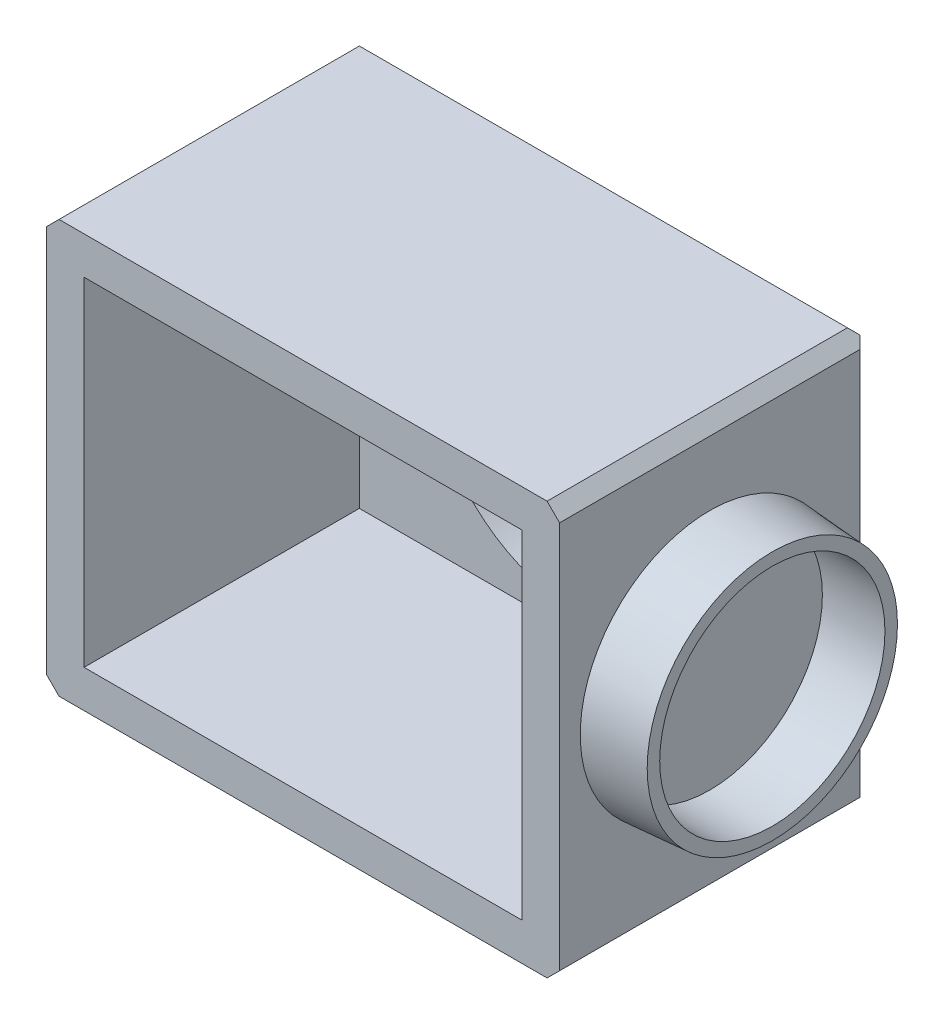
ISO-10303-21;
HEADER;
FILE_DESCRIPTION(('STEP AP214'),'2;1');
FILE_NAME('part.step','',(''),(''),'','','');
FILE_SCHEMA(('AUTOMOTIVE_DESIGN { 1 0 10303 214 1 1 1 1 }'));
ENDSEC;
DATA;
#1=APPLICATION_CONTEXT('core data for automotive mechanical design processes');
#2=APPLICATION_PROTOCOL_DEFINITION('international standard','automotive_design',2000,#1);
#3=PRODUCT_CONTEXT('',#1,'mechanical');
#4=PRODUCT('Part','Part','',(#3));
#5=PRODUCT_RELATED_PRODUCT_CATEGORY('part','',(#4));
#6=PRODUCT_DEFINITION_FORMATION('','',#4);
#7=PRODUCT_DEFINITION_CONTEXT('part definition',#1,'design');
#8=PRODUCT_DEFINITION('design','',#6,#7);
#9=PRODUCT_DEFINITION_SHAPE('','',#8);
#10=(LENGTH_UNIT() NAMED_UNIT(*) SI_UNIT(.MILLI.,.METRE.));
#11=(NAMED_UNIT(*) PLANE_ANGLE_UNIT() SI_UNIT($,.RADIAN.));
#12=(NAMED_UNIT(*) SI_UNIT($,.STERADIAN.) SOLID_ANGLE_UNIT());
#13=UNCERTAINTY_MEASURE_WITH_UNIT(LENGTH_MEASURE(1.E-05),#10,'distance_accuracy_value','');
#14=(GEOMETRIC_REPRESENTATION_CONTEXT(3) GLOBAL_UNCERTAINTY_ASSIGNED_CONTEXT((#13)) GLOBAL_UNIT_ASSIGNED_CONTEXT((#10,
#11,#12)) REPRESENTATION_CONTEXT('',''));
#15=CARTESIAN_POINT('',(0.,0.,0.));
#16=DIRECTION('',(0.,0.,1.));
#17=DIRECTION('',(1.,0.,0.));
#18=AXIS2_PLACEMENT_3D('',#15,#16,#17);
#19=CARTESIAN_POINT('',(0.,16.5,22.));
#20=DIRECTION('',(0.,1.,0.));
#21=DIRECTION('',(0.,0.,1.));
#22=AXIS2_PLACEMENT_3D('',#19,#20,#21);
#23=PLANE('',#22);
#24=DIRECTION('',(1.,0.,0.));
#25=VECTOR('',#24,1.);
#26=CARTESIAN_POINT('',(0.,16.5,22.));
#27=LINE('',#26,#25);
#28=CARTESIAN_POINT('',(-19.5,16.5,22.));
#29=VERTEX_POINT('',#28);
#30=CARTESIAN_POINT('',(19.5,16.5,22.));
#31=VERTEX_POINT('',#30);
#32=EDGE_CURVE('E205',#29,#31,#27,.T.);
#33=ORIENTED_EDGE('',*,*,#32,.T.);
#34=DIRECTION('',(0.,0.,-1.));
#35=VECTOR('',#34,1.);
#36=CARTESIAN_POINT('',(19.5,16.5,22.));
#37=LINE('',#36,#35);
#38=CARTESIAN_POINT('',(19.5,16.5,-1.99999999999998));
#39=VERTEX_POINT('',#38);
#40=EDGE_CURVE('E261',#31,#39,#37,.T.);
#41=ORIENTED_EDGE('',*,*,#40,.T.);
#42=DIRECTION('',(-1.,0.,0.));
#43=VECTOR('',#42,1.);
#44=CARTESIAN_POINT('',(0.,16.5,-1.99999999999998));
#45=LINE('',#44,#43);
#46=CARTESIAN_POINT('',(-19.5,16.5,-1.99999999999998));
#47=VERTEX_POINT('',#46);
#48=EDGE_CURVE('E218',#39,#47,#45,.T.);
#49=ORIENTED_EDGE('',*,*,#48,.T.);
#50=DIRECTION('',(0.,0.,1.));
#51=VECTOR('',#50,1.);
#52=CARTESIAN_POINT('',(-19.5,16.5,22.));
#53=LINE('',#52,#51);
#54=EDGE_CURVE('E257',#47,#29,#53,.T.);
#55=ORIENTED_EDGE('',*,*,#54,.T.);
#56=EDGE_LOOP('',(#33,#41,#49,#55));
#57=FACE_BOUND('',#56,.T.);
#58=ADVANCED_FACE('F59',(#57),#23,.T.);
#59=CARTESIAN_POINT('',(-20.5,0.,22.));
#60=DIRECTION('',(1.,0.,0.));
#61=DIRECTION('',(0.,0.,-1.));
#62=AXIS2_PLACEMENT_3D('',#59,#60,#61);
#63=PLANE('',#62);
#64=DIRECTION('',(0.,-1.,0.));
#65=VECTOR('',#64,1.);
#66=CARTESIAN_POINT('',(-20.5,-16.5,-1.99999999999998));
#67=LINE('',#66,#65);
#68=CARTESIAN_POINT('',(-20.5,15.5,-1.99999999999998));
#69=VERTEX_POINT('',#68);
#70=CARTESIAN_POINT('',(-20.5,-15.5,-1.99999999999998));
#71=VERTEX_POINT('',#70);
#72=EDGE_CURVE('E232',#69,#71,#67,.T.);
#73=ORIENTED_EDGE('',*,*,#72,.T.);
#74=DIRECTION('',(0.,0.,1.));
#75=VECTOR('',#74,1.);
#76=CARTESIAN_POINT('',(-20.5,-15.5,22.));
#77=LINE('',#76,#75);
#78=CARTESIAN_POINT('',(-20.5,-15.5,22.));
#79=VERTEX_POINT('',#78);
#80=EDGE_CURVE('E67',#71,#79,#77,.T.);
#81=ORIENTED_EDGE('',*,*,#80,.T.);
#82=DIRECTION('',(0.,-1.,0.));
#83=VECTOR('',#82,1.);
#84=CARTESIAN_POINT('',(-20.5,0.,22.));
#85=LINE('',#84,#83);
#86=CARTESIAN_POINT('',(-20.5,15.5,22.));
#87=VERTEX_POINT('',#86);
#88=EDGE_CURVE('E213',#87,#79,#85,.T.);
#89=ORIENTED_EDGE('',*,*,#88,.F.);
#90=DIRECTION('',(0.,0.,-1.));
#91=VECTOR('',#90,1.);
#92=CARTESIAN_POINT('',(-20.5,15.5,-1.99999999999998));
#93=LINE('',#92,#91);
#94=EDGE_CURVE('E249',#87,#69,#93,.T.);
#95=ORIENTED_EDGE('',*,*,#94,.T.);
#96=EDGE_LOOP('',(#73,#81,#89,#95));
#97=FACE_BOUND('',#96,.T.);
#98=ADVANCED_FACE('F331',(#97),#63,.F.);
#99=CARTESIAN_POINT('',(0.,-16.5,22.));
#100=DIRECTION('',(0.,1.,0.));
#101=DIRECTION('',(0.,0.,1.));
#102=AXIS2_PLACEMENT_3D('',#99,#100,#101);
#103=PLANE('',#102);
#104=DIRECTION('',(1.,0.,0.));
#105=VECTOR('',#104,1.);
#106=CARTESIAN_POINT('',(0.,-16.5,22.));
#107=LINE('',#106,#105);
#108=CARTESIAN_POINT('',(-19.5,-16.5,22.));
#109=VERTEX_POINT('',#108);
#110=CARTESIAN_POINT('',(19.5,-16.5,22.));
#111=VERTEX_POINT('',#110);
#112=EDGE_CURVE('E211',#109,#111,#107,.T.);
#113=ORIENTED_EDGE('',*,*,#112,.F.);
#114=DIRECTION('',(0.,0.,-1.));
#115=VECTOR('',#114,1.);
#116=CARTESIAN_POINT('',(-19.5,-16.5,22.));
#117=LINE('',#116,#115);
#118=CARTESIAN_POINT('',(-19.5,-16.5,-1.99999999999998));
#119=VERTEX_POINT('',#118);
#120=EDGE_CURVE('E286',#109,#119,#117,.T.);
#121=ORIENTED_EDGE('',*,*,#120,.T.);
#122=DIRECTION('',(1.,0.,0.));
#123=VECTOR('',#122,1.);
#124=CARTESIAN_POINT('',(19.5,-16.5,-1.99999999999998));
#125=LINE('',#124,#123);
#126=CARTESIAN_POINT('',(19.5,-16.5,-1.99999999999998));
#127=VERTEX_POINT('',#126);
#128=EDGE_CURVE('E239',#119,#127,#125,.T.);
#129=ORIENTED_EDGE('',*,*,#128,.T.);
#130=DIRECTION('',(0.,0.,1.));
#131=VECTOR('',#130,1.);
#132=CARTESIAN_POINT('',(19.5,-16.5,22.));
#133=LINE('',#132,#131);
#134=EDGE_CURVE('E281',#127,#111,#133,.T.);
#135=ORIENTED_EDGE('',*,*,#134,.T.);
#136=EDGE_LOOP('',(#113,#121,#129,#135));
#137=FACE_BOUND('',#136,.T.);
#138=ADVANCED_FACE('F305',(#137),#103,.F.);
#139=CARTESIAN_POINT('',(20.5,0.,22.));
#140=DIRECTION('',(1.,0.,0.));
#141=DIRECTION('',(0.,0.,-1.));
#142=AXIS2_PLACEMENT_3D('',#139,#140,#141);
#143=PLANE('',#142);
#144=CARTESIAN_POINT('',(20.5,0.,10.));
#145=DIRECTION('',(1.,0.,0.));
#146=DIRECTION('',(0.,0.,-1.));
#147=AXIS2_PLACEMENT_3D('',#144,#145,#146);
#148=CIRCLE('',#147,10.35);
#149=CARTESIAN_POINT('',(20.5,0.,-0.349999999999994));
#150=VERTEX_POINT('',#149);
#151=EDGE_CURVE('E423',#150,#150,#148,.T.);
#152=ORIENTED_EDGE('',*,*,#151,.F.);
#153=EDGE_LOOP('',(#152));
#154=FACE_BOUND('',#153,.T.);
#155=DIRECTION('',(0.,-1.,0.));
#156=VECTOR('',#155,1.);
#157=CARTESIAN_POINT('',(20.5,0.,22.));
#158=LINE('',#157,#156);
#159=CARTESIAN_POINT('',(20.5,15.5,22.));
#160=VERTEX_POINT('',#159);
#161=CARTESIAN_POINT('',(20.5,-15.5,22.));
#162=VERTEX_POINT('',#161);
#163=EDGE_CURVE('E208',#160,#162,#158,.T.);
#164=ORIENTED_EDGE('',*,*,#163,.T.);
#165=DIRECTION('',(0.,0.,-1.));
#166=VECTOR('',#165,1.);
#167=CARTESIAN_POINT('',(20.5,-15.5,-1.99999999999998));
#168=LINE('',#167,#166);
#169=CARTESIAN_POINT('',(20.5,-15.5,-1.99999999999998));
#170=VERTEX_POINT('',#169);
#171=EDGE_CURVE('E273',#162,#170,#168,.T.);
#172=ORIENTED_EDGE('',*,*,#171,.T.);
#173=DIRECTION('',(0.,1.,0.));
#174=VECTOR('',#173,1.);
#175=CARTESIAN_POINT('',(20.5,0.,-1.99999999999998));
#176=LINE('',#175,#174);
#177=CARTESIAN_POINT('',(20.5,15.5,-1.99999999999998));
#178=VERTEX_POINT('',#177);
#179=EDGE_CURVE('E223',#170,#178,#176,.T.);
#180=ORIENTED_EDGE('',*,*,#179,.T.);
#181=DIRECTION('',(0.,0.,1.));
#182=VECTOR('',#181,1.);
#183=CARTESIAN_POINT('',(20.5,15.5,22.));
#184=LINE('',#183,#182);
#185=EDGE_CURVE('E269',#178,#160,#184,.T.);
#186=ORIENTED_EDGE('',*,*,#185,.T.);
#187=EDGE_LOOP('',(#164,#172,#180,#186));
#188=FACE_BOUND('',#187,.T.);
#189=ADVANCED_FACE('F315',(#154,#188),#143,.T.);
#190=CARTESIAN_POINT('',(0.,0.,22.));
#191=DIRECTION('',(0.,0.,-1.));
#192=DIRECTION('',(-1.,0.,0.));
#193=AXIS2_PLACEMENT_3D('',#190,#191,#192);
#194=PLANE('',#193);
#195=DIRECTION('',(0.,-1.,0.));
#196=VECTOR('',#195,1.);
#197=CARTESIAN_POINT('',(-17.5,13.5,22.));
#198=LINE('',#197,#196);
#199=CARTESIAN_POINT('',(-17.5,13.5,22.));
#200=VERTEX_POINT('',#199);
#201=CARTESIAN_POINT('',(-17.5,-13.5,22.));
#202=VERTEX_POINT('',#201);
#203=EDGE_CURVE('E197',#200,#202,#198,.T.);
#204=ORIENTED_EDGE('',*,*,#203,.F.);
#205=DIRECTION('',(1.,0.,0.));
#206=VECTOR('',#205,1.);
#207=CARTESIAN_POINT('',(-17.5,13.5,22.));
#208=LINE('',#207,#206);
#209=CARTESIAN_POINT('',(17.5,13.5,22.));
#210=VERTEX_POINT('',#209);
#211=EDGE_CURVE('E445',#200,#210,#208,.T.);
#212=ORIENTED_EDGE('',*,*,#211,.T.);
#213=DIRECTION('',(0.,-1.,0.));
#214=VECTOR('',#213,1.);
#215=CARTESIAN_POINT('',(17.5,13.5,22.));
#216=LINE('',#215,#214);
#217=CARTESIAN_POINT('',(17.5,-13.5,22.));
#218=VERTEX_POINT('',#217);
#219=EDGE_CURVE('E194',#210,#218,#216,.T.);
#220=ORIENTED_EDGE('',*,*,#219,.T.);
#221=DIRECTION('',(1.,0.,0.));
#222=VECTOR('',#221,1.);
#223=CARTESIAN_POINT('',(-17.5,-13.5,22.));
#224=LINE('',#223,#222);
#225=EDGE_CURVE('E201',#202,#218,#224,.T.);
#226=ORIENTED_EDGE('',*,*,#225,.F.);
#227=EDGE_LOOP('',(#204,#212,#220,#226));
#228=FACE_BOUND('',#227,.T.);
#229=ORIENTED_EDGE('',*,*,#88,.T.);
#230=DIRECTION('',(-0.707106781186545,0.70710678118655,0.));
#231=VECTOR('',#230,1.);
#232=CARTESIAN_POINT('',(-19.5,-16.5,22.));
#233=LINE('',#232,#231);
#234=EDGE_CURVE('E12',#79,#109,#233,.F.);
#235=ORIENTED_EDGE('',*,*,#234,.T.);
#236=ORIENTED_EDGE('',*,*,#112,.T.);
#237=DIRECTION('',(0.70710678118655,0.707106781186545,0.));
#238=VECTOR('',#237,1.);
#239=CARTESIAN_POINT('',(20.5,-15.5,22.));
#240=LINE('',#239,#238);
#241=EDGE_CURVE('E284',#111,#162,#240,.T.);
#242=ORIENTED_EDGE('',*,*,#241,.T.);
#243=ORIENTED_EDGE('',*,*,#163,.F.);
#244=DIRECTION('',(0.707106781186545,-0.70710678118655,0.));
#245=VECTOR('',#244,1.);
#246=CARTESIAN_POINT('',(19.5,16.5,22.));
#247=LINE('',#246,#245);
#248=EDGE_CURVE('E271',#160,#31,#247,.F.);
#249=ORIENTED_EDGE('',*,*,#248,.T.);
#250=ORIENTED_EDGE('',*,*,#32,.F.);
#251=DIRECTION('',(-0.70710678118655,-0.707106781186545,0.));
#252=VECTOR('',#251,1.);
#253=CARTESIAN_POINT('',(-20.5,15.5,22.));
#254=LINE('',#253,#252);
#255=EDGE_CURVE('E259',#29,#87,#254,.T.);
#256=ORIENTED_EDGE('',*,*,#255,.T.);
#257=EDGE_LOOP('',(#229,#235,#236,#242,#243,#249,#250,#256));
#258=FACE_BOUND('',#257,.T.);
#259=ADVANCED_FACE('F303',(#228,#258),#194,.F.);
#260=CARTESIAN_POINT('',(-17.5,13.5,22.));
#261=DIRECTION('',(0.,1.,0.));
#262=DIRECTION('',(0.,0.,1.));
#263=AXIS2_PLACEMENT_3D('',#260,#261,#262);
#264=PLANE('',#263);
#265=DIRECTION('',(1.,0.,0.));
#266=VECTOR('',#265,1.);
#267=CARTESIAN_POINT('',(-17.5,13.5,0.));
#268=LINE('',#267,#266);
#269=CARTESIAN_POINT('',(-17.5,13.5,0.));
#270=VERTEX_POINT('',#269);
#271=CARTESIAN_POINT('',(17.5,13.5,0.));
#272=VERTEX_POINT('',#271);
#273=EDGE_CURVE('E175',#270,#272,#268,.T.);
#274=ORIENTED_EDGE('',*,*,#273,.T.);
#275=DIRECTION('',(0.,0.,-1.));
#276=VECTOR('',#275,1.);
#277=CARTESIAN_POINT('',(17.5,13.5,22.));
#278=LINE('',#277,#276);
#279=EDGE_CURVE('E186',#210,#272,#278,.T.);
#280=ORIENTED_EDGE('',*,*,#279,.F.);
#281=ORIENTED_EDGE('',*,*,#211,.F.);
#282=DIRECTION('',(0.,0.,-1.));
#283=VECTOR('',#282,1.);
#284=CARTESIAN_POINT('',(-17.5,13.5,22.));
#285=LINE('',#284,#283);
#286=EDGE_CURVE('E188',#200,#270,#285,.T.);
#287=ORIENTED_EDGE('',*,*,#286,.T.);
#288=EDGE_LOOP('',(#274,#280,#281,#287));
#289=FACE_BOUND('',#288,.T.);
#290=ADVANCED_FACE('F184',(#289),#264,.F.);
#291=CARTESIAN_POINT('',(-17.5,13.5,22.));
#292=DIRECTION('',(1.,0.,0.));
#293=DIRECTION('',(0.,0.,-1.));
#294=AXIS2_PLACEMENT_3D('',#291,#292,#293);
#295=PLANE('',#294);
#296=DIRECTION('',(0.,-1.,0.));
#297=VECTOR('',#296,1.);
#298=CARTESIAN_POINT('',(-17.5,13.5,0.));
#299=LINE('',#298,#297);
#300=CARTESIAN_POINT('',(-17.5,-13.5,0.));
#301=VERTEX_POINT('',#300);
#302=EDGE_CURVE('E447',#270,#301,#299,.T.);
#303=ORIENTED_EDGE('',*,*,#302,.F.);
#304=ORIENTED_EDGE('',*,*,#286,.F.);
#305=ORIENTED_EDGE('',*,*,#203,.T.);
#306=DIRECTION('',(0.,0.,-1.));
#307=VECTOR('',#306,1.);
#308=CARTESIAN_POINT('',(-17.5,-13.5,22.));
#309=LINE('',#308,#307);
#310=EDGE_CURVE('E199',#202,#301,#309,.T.);
#311=ORIENTED_EDGE('',*,*,#310,.T.);
#312=EDGE_LOOP('',(#303,#304,#305,#311));
#313=FACE_BOUND('',#312,.T.);
#314=ADVANCED_FACE('F368',(#313),#295,.T.);
#315=CARTESIAN_POINT('',(-17.5,-13.5,22.));
#316=DIRECTION('',(0.,1.,0.));
#317=DIRECTION('',(0.,0.,1.));
#318=AXIS2_PLACEMENT_3D('',#315,#316,#317);
#319=PLANE('',#318);
#320=DIRECTION('',(1.,0.,0.));
#321=VECTOR('',#320,1.);
#322=CARTESIAN_POINT('',(-17.5,-13.5,0.));
#323=LINE('',#322,#321);
#324=CARTESIAN_POINT('',(17.5,-13.5,0.));
#325=VERTEX_POINT('',#324);
#326=EDGE_CURVE('E178',#301,#325,#323,.T.);
#327=ORIENTED_EDGE('',*,*,#326,.F.);
#328=ORIENTED_EDGE('',*,*,#310,.F.);
#329=ORIENTED_EDGE('',*,*,#225,.T.);
#330=DIRECTION('',(0.,0.,-1.));
#331=VECTOR('',#330,1.);
#332=CARTESIAN_POINT('',(17.5,-13.5,22.));
#333=LINE('',#332,#331);
#334=EDGE_CURVE('E196',#218,#325,#333,.T.);
#335=ORIENTED_EDGE('',*,*,#334,.T.);
#336=EDGE_LOOP('',(#327,#328,#329,#335));
#337=FACE_BOUND('',#336,.T.);
#338=ADVANCED_FACE('F371',(#337),#319,.T.);
#339=CARTESIAN_POINT('',(17.5,13.5,22.));
#340=DIRECTION('',(1.,0.,0.));
#341=DIRECTION('',(0.,0.,-1.));
#342=AXIS2_PLACEMENT_3D('',#339,#340,#341);
#343=PLANE('',#342);
#344=DIRECTION('',(0.,-1.,0.));
#345=VECTOR('',#344,1.);
#346=CARTESIAN_POINT('',(17.5,13.5,0.));
#347=LINE('',#346,#345);
#348=EDGE_CURVE('E172',#272,#325,#347,.T.);
#349=ORIENTED_EDGE('',*,*,#348,.T.);
#350=ORIENTED_EDGE('',*,*,#334,.F.);
#351=ORIENTED_EDGE('',*,*,#219,.F.);
#352=ORIENTED_EDGE('',*,*,#279,.T.);
#353=EDGE_LOOP('',(#349,#350,#351,#352));
#354=FACE_BOUND('',#353,.T.);
#355=ADVANCED_FACE('F192',(#354),#343,.F.);
#356=CARTESIAN_POINT('',(0.,0.,0.));
#357=DIRECTION('',(0.,0.,-1.));
#358=DIRECTION('',(-1.,0.,0.));
#359=AXIS2_PLACEMENT_3D('',#356,#357,#358);
#360=PLANE('',#359);
#361=CARTESIAN_POINT('',(-14.5,0.,0.));
#362=DIRECTION('',(0.,0.,-1.));
#363=DIRECTION('',(-1.,0.,0.));
#364=AXIS2_PLACEMENT_3D('',#361,#362,#363);
#365=CIRCLE('',#364,1.1);
#366=CARTESIAN_POINT('',(-15.6,0.,0.));
#367=VERTEX_POINT('',#366);
#368=EDGE_CURVE('E246',#367,#367,#365,.F.);
#369=ORIENTED_EDGE('',*,*,#368,.F.);
#370=EDGE_LOOP('',(#369));
#371=FACE_BOUND('',#370,.T.);
#372=CARTESIAN_POINT('',(14.5,0.,0.));
#373=DIRECTION('',(0.,0.,-1.));
#374=DIRECTION('',(-1.,0.,0.));
#375=AXIS2_PLACEMENT_3D('',#372,#373,#374);
#376=CIRCLE('',#375,1.1);
#377=CARTESIAN_POINT('',(13.4,0.,0.));
#378=VERTEX_POINT('',#377);
#379=EDGE_CURVE('E243',#378,#378,#376,.F.);
#380=ORIENTED_EDGE('',*,*,#379,.F.);
#381=EDGE_LOOP('',(#380));
#382=FACE_BOUND('',#381,.T.);
#383=CARTESIAN_POINT('',(0.,0.,0.));
#384=DIRECTION('',(0.,0.,-1.));
#385=DIRECTION('',(-1.,0.,0.));
#386=AXIS2_PLACEMENT_3D('',#383,#384,#385);
#387=CIRCLE('',#386,12.);
#388=CARTESIAN_POINT('',(-12.,0.,0.));
#389=VERTEX_POINT('',#388);
#390=EDGE_CURVE('E190',#389,#389,#387,.T.);
#391=ORIENTED_EDGE('',*,*,#390,.T.);
#392=EDGE_LOOP('',(#391));
#393=FACE_BOUND('',#392,.T.);
#394=ORIENTED_EDGE('',*,*,#348,.F.);
#395=ORIENTED_EDGE('',*,*,#273,.F.);
#396=ORIENTED_EDGE('',*,*,#302,.T.);
#397=ORIENTED_EDGE('',*,*,#326,.T.);
#398=EDGE_LOOP('',(#394,#395,#396,#397));
#399=FACE_BOUND('',#398,.T.);
#400=ADVANCED_FACE('F174',(#371,#382,#393,#399),#360,.F.);
#401=CARTESIAN_POINT('',(0.,0.,-3.));
#402=DIRECTION('',(0.,0.,-1.));
#403=DIRECTION('',(-1.,0.,0.));
#404=AXIS2_PLACEMENT_3D('',#401,#402,#403);
#405=PLANE('',#404);
#406=CARTESIAN_POINT('',(0.,0.,-3.));
#407=DIRECTION('',(0.,0.,-1.));
#408=DIRECTION('',(-1.,0.,0.));
#409=AXIS2_PLACEMENT_3D('',#406,#407,#408);
#410=CIRCLE('',#409,12.);
#411=CARTESIAN_POINT('',(-12.,0.,-3.));
#412=VERTEX_POINT('',#411);
#413=EDGE_CURVE('E440',#412,#412,#410,.T.);
#414=ORIENTED_EDGE('',*,*,#413,.F.);
#415=EDGE_LOOP('',(#414));
#416=FACE_BOUND('',#415,.T.);
#417=DIRECTION('',(0.,-1.,0.));
#418=VECTOR('',#417,1.);
#419=CARTESIAN_POINT('',(19.5,0.,-3.));
#420=LINE('',#419,#418);
#421=CARTESIAN_POINT('',(19.5,15.5,-3.));
#422=VERTEX_POINT('',#421);
#423=CARTESIAN_POINT('',(19.5,-15.5,-3.));
#424=VERTEX_POINT('',#423);
#425=EDGE_CURVE('E220',#422,#424,#420,.T.);
#426=ORIENTED_EDGE('',*,*,#425,.T.);
#427=DIRECTION('',(-1.,0.,0.));
#428=VECTOR('',#427,1.);
#429=CARTESIAN_POINT('',(-19.5,-15.5,-3.));
#430=LINE('',#429,#428);
#431=CARTESIAN_POINT('',(-19.5,-15.5,-3.));
#432=VERTEX_POINT('',#431);
#433=EDGE_CURVE('E234',#424,#432,#430,.T.);
#434=ORIENTED_EDGE('',*,*,#433,.T.);
#435=DIRECTION('',(0.,1.,0.));
#436=VECTOR('',#435,1.);
#437=CARTESIAN_POINT('',(-19.5,15.5,-3.));
#438=LINE('',#437,#436);
#439=CARTESIAN_POINT('',(-19.5,15.5,-3.));
#440=VERTEX_POINT('',#439);
#441=EDGE_CURVE('E227',#432,#440,#438,.T.);
#442=ORIENTED_EDGE('',*,*,#441,.T.);
#443=DIRECTION('',(1.,0.,0.));
#444=VECTOR('',#443,1.);
#445=CARTESIAN_POINT('',(0.,15.5,-3.));
#446=LINE('',#445,#444);
#447=EDGE_CURVE('E215',#440,#422,#446,.T.);
#448=ORIENTED_EDGE('',*,*,#447,.T.);
#449=EDGE_LOOP('',(#426,#434,#442,#448));
#450=FACE_BOUND('',#449,.T.);
#451=ADVANCED_FACE('F338',(#416,#450),#405,.T.);
#452=CARTESIAN_POINT('',(0.,0.,2.));
#453=DIRECTION('',(0.,0.,-1.));
#454=DIRECTION('',(-1.,0.,0.));
#455=AXIS2_PLACEMENT_3D('',#452,#453,#454);
#456=CYLINDRICAL_SURFACE('',#455,12.);
#457=ORIENTED_EDGE('',*,*,#413,.T.);
#458=EDGE_LOOP('',(#457));
#459=FACE_BOUND('',#458,.T.);
#460=ORIENTED_EDGE('',*,*,#390,.F.);
#461=EDGE_LOOP('',(#460));
#462=FACE_BOUND('',#461,.T.);
#463=ADVANCED_FACE('F349',(#459,#462),#456,.F.);
#464=CARTESIAN_POINT('',(0.,15.5,-3.));
#465=DIRECTION('',(0.,-0.70710678118655,0.707106781186545));
#466=DIRECTION('',(1.,0.,0.));
#467=AXIS2_PLACEMENT_3D('',#464,#465,#466);
#468=PLANE('',#467);
#469=ORIENTED_EDGE('',*,*,#48,.F.);
#470=DIRECTION('',(0.577350269189622,-0.577350269189626,-0.57735026918963));
#471=VECTOR('',#470,1.);
#472=CARTESIAN_POINT('',(13.6666666666668,22.3333333333333,3.83333333333333));
#473=LINE('',#472,#471);
#474=CARTESIAN_POINT('',(20.,16.,-2.5));
#475=VERTEX_POINT('',#474);
#476=EDGE_CURVE('E264',#39,#475,#473,.T.);
#477=ORIENTED_EDGE('',*,*,#476,.T.);
#478=DIRECTION('',(-0.577350269189624,-0.577350269189624,-0.577350269189629));
#479=VECTOR('',#478,1.);
#480=CARTESIAN_POINT('',(13.,9.00000000000003,-9.50000000000002));
#481=LINE('',#480,#479);
#482=EDGE_CURVE('E225',#475,#422,#481,.T.);
#483=ORIENTED_EDGE('',*,*,#482,.T.);
#484=ORIENTED_EDGE('',*,*,#447,.F.);
#485=DIRECTION('',(0.577350269189624,-0.577350269189624,-0.577350269189629));
#486=VECTOR('',#485,1.);
#487=CARTESIAN_POINT('',(-13.,9.00000000000003,-9.50000000000002));
#488=LINE('',#487,#486);
#489=CARTESIAN_POINT('',(-20.,16.,-2.5));
#490=VERTEX_POINT('',#489);
#491=EDGE_CURVE('E229',#440,#490,#488,.F.);
#492=ORIENTED_EDGE('',*,*,#491,.T.);
#493=DIRECTION('',(-0.577350269189627,-0.577350269189623,-0.577350269189627));
#494=VECTOR('',#493,1.);
#495=CARTESIAN_POINT('',(-13.6666666666666,22.3333333333333,3.83333333333337));
#496=LINE('',#495,#494);
#497=EDGE_CURVE('E254',#490,#47,#496,.F.);
#498=ORIENTED_EDGE('',*,*,#497,.T.);
#499=EDGE_LOOP('',(#469,#477,#483,#484,#492,#498));
#500=FACE_BOUND('',#499,.T.);
#501=ADVANCED_FACE('F334',(#500),#468,.F.);
#502=CARTESIAN_POINT('',(19.5,0.,-3.));
#503=DIRECTION('',(-0.70710678118655,0.,0.707106781186545));
#504=DIRECTION('',(0.,-1.,0.));
#505=AXIS2_PLACEMENT_3D('',#502,#503,#504);
#506=PLANE('',#505);
#507=ORIENTED_EDGE('',*,*,#179,.F.);
#508=DIRECTION('',(0.577350269189626,0.577350269189622,0.57735026918963));
#509=VECTOR('',#508,1.);
#510=CARTESIAN_POINT('',(25.,-11.0000000000001,2.5));
#511=LINE('',#510,#509);
#512=CARTESIAN_POINT('',(20.,-16.,-2.5));
#513=VERTEX_POINT('',#512);
#514=EDGE_CURVE('E276',#170,#513,#511,.F.);
#515=ORIENTED_EDGE('',*,*,#514,.T.);
#516=DIRECTION('',(0.577350269189624,-0.577350269189624,0.577350269189629));
#517=VECTOR('',#516,1.);
#518=CARTESIAN_POINT('',(14.3333333333334,-10.3333333333334,-8.16666666666668));
#519=LINE('',#518,#517);
#520=EDGE_CURVE('E241',#513,#424,#519,.F.);
#521=ORIENTED_EDGE('',*,*,#520,.T.);
#522=ORIENTED_EDGE('',*,*,#425,.F.);
#523=ORIENTED_EDGE('',*,*,#482,.F.);
#524=DIRECTION('',(0.577350269189623,-0.577350269189627,0.577350269189627));
#525=VECTOR('',#524,1.);
#526=CARTESIAN_POINT('',(25.,11.,2.50000000000003));
#527=LINE('',#526,#525);
#528=EDGE_CURVE('E266',#475,#178,#527,.T.);
#529=ORIENTED_EDGE('',*,*,#528,.T.);
#530=EDGE_LOOP('',(#507,#515,#521,#522,#523,#529));
#531=FACE_BOUND('',#530,.T.);
#532=ADVANCED_FACE('F340',(#531),#506,.F.);
#533=CARTESIAN_POINT('',(-19.5,0.,-3.));
#534=DIRECTION('',(-0.70710678118655,0.,-0.707106781186545));
#535=DIRECTION('',(0.,-1.,0.));
#536=AXIS2_PLACEMENT_3D('',#533,#534,#535);
#537=PLANE('',#536);
#538=DIRECTION('',(-0.577350269189624,-0.577350269189624,0.577350269189629));
#539=VECTOR('',#538,1.);
#540=CARTESIAN_POINT('',(-14.3333333333334,-10.3333333333334,-8.16666666666668));
#541=LINE('',#540,#539);
#542=CARTESIAN_POINT('',(-20.,-16.,-2.5));
#543=VERTEX_POINT('',#542);
#544=EDGE_CURVE('E237',#432,#543,#541,.T.);
#545=ORIENTED_EDGE('',*,*,#544,.T.);
#546=DIRECTION('',(0.577350269189623,-0.577350269189627,-0.577350269189627));
#547=VECTOR('',#546,1.);
#548=CARTESIAN_POINT('',(-25.,-11.,2.50000000000003));
#549=LINE('',#548,#547);
#550=EDGE_CURVE('E81',#543,#71,#549,.F.);
#551=ORIENTED_EDGE('',*,*,#550,.T.);
#552=ORIENTED_EDGE('',*,*,#72,.F.);
#553=DIRECTION('',(0.577350269189626,0.577350269189622,-0.57735026918963));
#554=VECTOR('',#553,1.);
#555=CARTESIAN_POINT('',(-25.,11.0000000000001,2.5));
#556=LINE('',#555,#554);
#557=EDGE_CURVE('E252',#69,#490,#556,.T.);
#558=ORIENTED_EDGE('',*,*,#557,.T.);
#559=ORIENTED_EDGE('',*,*,#491,.F.);
#560=ORIENTED_EDGE('',*,*,#441,.F.);
#561=EDGE_LOOP('',(#545,#551,#552,#558,#559,#560));
#562=FACE_BOUND('',#561,.T.);
#563=ADVANCED_FACE('F298',(#562),#537,.T.);
#564=CARTESIAN_POINT('',(0.,-15.5,-3.));
#565=DIRECTION('',(0.,-0.70710678118655,-0.707106781186545));
#566=DIRECTION('',(1.,0.,0.));
#567=AXIS2_PLACEMENT_3D('',#564,#565,#566);
#568=PLANE('',#567);
#569=ORIENTED_EDGE('',*,*,#128,.F.);
#570=DIRECTION('',(0.577350269189622,-0.577350269189626,0.57735026918963));
#571=VECTOR('',#570,1.);
#572=CARTESIAN_POINT('',(-13.6666666666668,-22.3333333333333,3.83333333333333));
#573=LINE('',#572,#571);
#574=EDGE_CURVE('E289',#119,#543,#573,.F.);
#575=ORIENTED_EDGE('',*,*,#574,.T.);
#576=ORIENTED_EDGE('',*,*,#544,.F.);
#577=ORIENTED_EDGE('',*,*,#433,.F.);
#578=ORIENTED_EDGE('',*,*,#520,.F.);
#579=DIRECTION('',(-0.577350269189627,-0.577350269189623,0.577350269189627));
#580=VECTOR('',#579,1.);
#581=CARTESIAN_POINT('',(13.6666666666666,-22.3333333333333,3.83333333333337));
#582=LINE('',#581,#580);
#583=EDGE_CURVE('E278',#513,#127,#582,.T.);
#584=ORIENTED_EDGE('',*,*,#583,.T.);
#585=EDGE_LOOP('',(#569,#575,#576,#577,#578,#584));
#586=FACE_BOUND('',#585,.T.);
#587=ADVANCED_FACE('F293',(#586),#568,.T.);
#588=CARTESIAN_POINT('',(14.5,0.,0.));
#589=DIRECTION('',(0.,0.,-1.));
#590=DIRECTION('',(1.,0.,0.));
#591=AXIS2_PLACEMENT_3D('',#588,#589,#590);
#592=CONICAL_SURFACE('',#591,1.1,0.05235987755983);
#593=CARTESIAN_POINT('',(14.5,0.,6.));
#594=DIRECTION('',(0.,0.,1.));
#595=DIRECTION('',(1.,0.,0.));
#596=AXIS2_PLACEMENT_3D('',#593,#594,#595);
#597=CIRCLE('',#596,0.785553324301753);
#598=CARTESIAN_POINT('',(15.2855533243018,0.,6.));
#599=VERTEX_POINT('',#598);
#600=EDGE_CURVE('E437',#599,#599,#597,.T.);
#601=ORIENTED_EDGE('',*,*,#600,.F.);
#602=EDGE_LOOP('',(#601));
#603=FACE_BOUND('',#602,.T.);
#604=ORIENTED_EDGE('',*,*,#379,.T.);
#605=EDGE_LOOP('',(#604));
#606=FACE_BOUND('',#605,.T.);
#607=ADVANCED_FACE('F387',(#603,#606),#592,.T.);
#608=CARTESIAN_POINT('',(14.5,0.,6.));
#609=DIRECTION('',(0.,0.,1.));
#610=DIRECTION('',(1.,0.,0.));
#611=AXIS2_PLACEMENT_3D('',#608,#609,#610);
#612=PLANE('',#611);
#613=ORIENTED_EDGE('',*,*,#600,.T.);
#614=EDGE_LOOP('',(#613));
#615=FACE_BOUND('',#614,.T.);
#616=ADVANCED_FACE('F390',(#615),#612,.T.);
#617=CARTESIAN_POINT('',(-14.5,0.,0.));
#618=DIRECTION('',(0.,0.,-1.));
#619=DIRECTION('',(-1.,0.,0.));
#620=AXIS2_PLACEMENT_3D('',#617,#618,#619);
#621=CONICAL_SURFACE('',#620,1.1,0.05235987755983);
#622=CARTESIAN_POINT('',(-14.5,0.,6.));
#623=DIRECTION('',(0.,0.,-1.));
#624=DIRECTION('',(-1.,0.,0.));
#625=AXIS2_PLACEMENT_3D('',#622,#623,#624);
#626=CIRCLE('',#625,0.785553324301753);
#627=CARTESIAN_POINT('',(-15.2855533243018,0.,6.));
#628=VERTEX_POINT('',#627);
#629=EDGE_CURVE('E434',#628,#628,#626,.F.);
#630=ORIENTED_EDGE('',*,*,#629,.F.);
#631=EDGE_LOOP('',(#630));
#632=FACE_BOUND('',#631,.T.);
#633=ORIENTED_EDGE('',*,*,#368,.T.);
#634=EDGE_LOOP('',(#633));
#635=FACE_BOUND('',#634,.T.);
#636=ADVANCED_FACE('F394',(#632,#635),#621,.T.);
#637=CARTESIAN_POINT('',(-14.5,0.,6.));
#638=DIRECTION('',(0.,0.,-1.));
#639=DIRECTION('',(-1.,0.,0.));
#640=AXIS2_PLACEMENT_3D('',#637,#638,#639);
#641=PLANE('',#640);
#642=ORIENTED_EDGE('',*,*,#629,.T.);
#643=EDGE_LOOP('',(#642));
#644=FACE_BOUND('',#643,.T.);
#645=ADVANCED_FACE('F398',(#644),#641,.F.);
#646=CARTESIAN_POINT('',(-20.5,15.5,22.));
#647=DIRECTION('',(-0.707106781186545,0.70710678118655,0.));
#648=DIRECTION('',(0.,0.,1.));
#649=AXIS2_PLACEMENT_3D('',#646,#647,#648);
#650=PLANE('',#649);
#651=ORIENTED_EDGE('',*,*,#255,.F.);
#652=ORIENTED_EDGE('',*,*,#54,.F.);
#653=ORIENTED_EDGE('',*,*,#497,.F.);
#654=ORIENTED_EDGE('',*,*,#557,.F.);
#655=ORIENTED_EDGE('',*,*,#94,.F.);
#656=EDGE_LOOP('',(#651,#652,#653,#654,#655));
#657=FACE_BOUND('',#656,.T.);
#658=ADVANCED_FACE('F329',(#657),#650,.T.);
#659=CARTESIAN_POINT('',(19.5,16.5,22.));
#660=DIRECTION('',(-0.70710678118655,-0.707106781186545,0.));
#661=DIRECTION('',(0.,0.,-1.));
#662=AXIS2_PLACEMENT_3D('',#659,#660,#661);
#663=PLANE('',#662);
#664=ORIENTED_EDGE('',*,*,#248,.F.);
#665=ORIENTED_EDGE('',*,*,#185,.F.);
#666=ORIENTED_EDGE('',*,*,#528,.F.);
#667=ORIENTED_EDGE('',*,*,#476,.F.);
#668=ORIENTED_EDGE('',*,*,#40,.F.);
#669=EDGE_LOOP('',(#664,#665,#666,#667,#668));
#670=FACE_BOUND('',#669,.T.);
#671=ADVANCED_FACE('F320',(#670),#663,.F.);
#672=CARTESIAN_POINT('',(20.5,-15.5,22.));
#673=DIRECTION('',(0.707106781186545,-0.70710678118655,0.));
#674=DIRECTION('',(0.,0.,1.));
#675=AXIS2_PLACEMENT_3D('',#672,#673,#674);
#676=PLANE('',#675);
#677=ORIENTED_EDGE('',*,*,#241,.F.);
#678=ORIENTED_EDGE('',*,*,#134,.F.);
#679=ORIENTED_EDGE('',*,*,#583,.F.);
#680=ORIENTED_EDGE('',*,*,#514,.F.);
#681=ORIENTED_EDGE('',*,*,#171,.F.);
#682=EDGE_LOOP('',(#677,#678,#679,#680,#681));
#683=FACE_BOUND('',#682,.T.);
#684=ADVANCED_FACE('F311',(#683),#676,.T.);
#685=CARTESIAN_POINT('',(-19.5,-16.5,22.));
#686=DIRECTION('',(0.70710678118655,0.707106781186545,0.));
#687=DIRECTION('',(0.,0.,-1.));
#688=AXIS2_PLACEMENT_3D('',#685,#686,#687);
#689=PLANE('',#688);
#690=ORIENTED_EDGE('',*,*,#234,.F.);
#691=ORIENTED_EDGE('',*,*,#80,.F.);
#692=ORIENTED_EDGE('',*,*,#550,.F.);
#693=ORIENTED_EDGE('',*,*,#574,.F.);
#694=ORIENTED_EDGE('',*,*,#120,.F.);
#695=EDGE_LOOP('',(#690,#691,#692,#693,#694));
#696=FACE_BOUND('',#695,.T.);
#697=ADVANCED_FACE('F61',(#696),#689,.F.);
#698=CARTESIAN_POINT('',(20.5,0.,10.));
#699=DIRECTION('',(-1.,0.,0.));
#700=DIRECTION('',(0.,0.,-1.));
#701=AXIS2_PLACEMENT_3D('',#698,#699,#700);
#702=CONICAL_SURFACE('',#701,10.35,0.0698131700797733);
#703=CARTESIAN_POINT('',(25.5,0.,10.));
#704=DIRECTION('',(1.,0.,0.));
#705=DIRECTION('',(0.,0.,-1.));
#706=AXIS2_PLACEMENT_3D('',#703,#704,#705);
#707=CIRCLE('',#706,10.0003659402824);
#708=CARTESIAN_POINT('',(25.5,0.,-0.000365940282440885));
#709=VERTEX_POINT('',#708);
#710=EDGE_CURVE('E427',#709,#709,#707,.T.);
#711=ORIENTED_EDGE('',*,*,#710,.F.);
#712=EDGE_LOOP('',(#711));
#713=FACE_BOUND('',#712,.T.);
#714=ORIENTED_EDGE('',*,*,#151,.T.);
#715=EDGE_LOOP('',(#714));
#716=FACE_BOUND('',#715,.T.);
#717=ADVANCED_FACE('F403',(#713,#716),#702,.T.);
#718=CARTESIAN_POINT('',(25.5,0.,10.));
#719=DIRECTION('',(1.,0.,0.));
#720=DIRECTION('',(0.,0.,-1.));
#721=AXIS2_PLACEMENT_3D('',#718,#719,#720);
#722=PLANE('',#721);
#723=CARTESIAN_POINT('',(25.5,0.,10.));
#724=DIRECTION('',(1.,0.,0.));
#725=DIRECTION('',(0.,0.,-1.));
#726=AXIS2_PLACEMENT_3D('',#723,#724,#725);
#727=CIRCLE('',#726,9.);
#728=CARTESIAN_POINT('',(25.5,0.,1.00000000000001));
#729=VERTEX_POINT('',#728);
#730=EDGE_CURVE('E424',#729,#729,#727,.T.);
#731=ORIENTED_EDGE('',*,*,#730,.F.);
#732=EDGE_LOOP('',(#731));
#733=FACE_BOUND('',#732,.T.);
#734=ORIENTED_EDGE('',*,*,#710,.T.);
#735=EDGE_LOOP('',(#734));
#736=FACE_BOUND('',#735,.T.);
#737=ADVANCED_FACE('F406',(#733,#736),#722,.T.);
#738=CARTESIAN_POINT('',(20.5,0.,10.));
#739=DIRECTION('',(1.,0.,0.));
#740=DIRECTION('',(0.,0.,-1.));
#741=AXIS2_PLACEMENT_3D('',#738,#739,#740);
#742=CYLINDRICAL_SURFACE('',#741,9.);
#743=CARTESIAN_POINT('',(20.5,0.,10.));
#744=DIRECTION('',(1.,0.,0.));
#745=DIRECTION('',(0.,0.,-1.));
#746=AXIS2_PLACEMENT_3D('',#743,#744,#745);
#747=CIRCLE('',#746,9.);
#748=CARTESIAN_POINT('',(20.5,0.,1.00000000000001));
#749=VERTEX_POINT('',#748);
#750=EDGE_CURVE('E422',#749,#749,#747,.T.);
#751=ORIENTED_EDGE('',*,*,#750,.F.);
#752=EDGE_LOOP('',(#751));
#753=FACE_BOUND('',#752,.T.);
#754=ORIENTED_EDGE('',*,*,#730,.T.);
#755=EDGE_LOOP('',(#754));
#756=FACE_BOUND('',#755,.T.);
#757=ADVANCED_FACE('F410',(#753,#756),#742,.F.);
#758=CARTESIAN_POINT('',(20.5,0.,10.));
#759=DIRECTION('',(1.,0.,0.));
#760=DIRECTION('',(0.,0.,-1.));
#761=AXIS2_PLACEMENT_3D('',#758,#759,#760);
#762=PLANE('',#761);
#763=ORIENTED_EDGE('',*,*,#750,.T.);
#764=EDGE_LOOP('',(#763));
#765=FACE_BOUND('',#764,.T.);
#766=ADVANCED_FACE('F414',(#765),#762,.T.);
#767=CLOSED_SHELL('',(#58,#98,#138,#189,#259,#290,#314,#338,#355,#400,#451,#463,#501,#532,#563,
#587,#607,#616,#636,#645,#658,#671,#684,#697,#717,#737,#757,#766));
#768=MANIFOLD_SOLID_BREP('B2',#767);
#769=ADVANCED_BREP_SHAPE_REPRESENTATION('',(#18,#768),#14);
#770=SHAPE_DEFINITION_REPRESENTATION(#9,#769);
ENDSEC;
END-ISO-10303-21;
